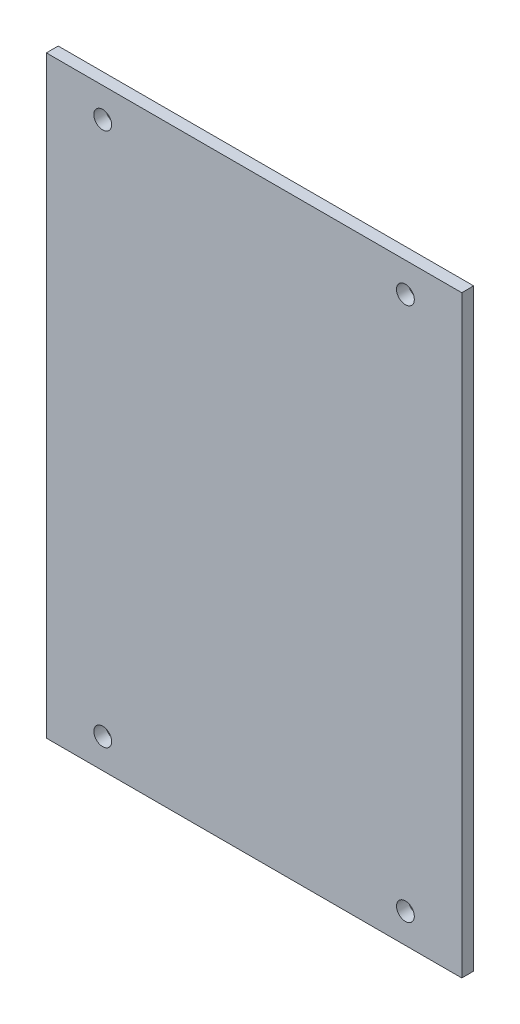
ISO-10303-21;
HEADER;
FILE_DESCRIPTION(('STEP AP214'),'2;1');
FILE_NAME('part.step','',(''),(''),'','','');
FILE_SCHEMA(('AUTOMOTIVE_DESIGN { 1 0 10303 214 1 1 1 1 }'));
ENDSEC;
DATA;
#1=APPLICATION_CONTEXT('core data for automotive mechanical design processes');
#2=APPLICATION_PROTOCOL_DEFINITION('international standard','automotive_design',2000,#1);
#3=PRODUCT_CONTEXT('',#1,'mechanical');
#4=PRODUCT('Part','Part','',(#3));
#5=PRODUCT_RELATED_PRODUCT_CATEGORY('part','',(#4));
#6=PRODUCT_DEFINITION_FORMATION('','',#4);
#7=PRODUCT_DEFINITION_CONTEXT('part definition',#1,'design');
#8=PRODUCT_DEFINITION('design','',#6,#7);
#9=PRODUCT_DEFINITION_SHAPE('','',#8);
#10=(LENGTH_UNIT() NAMED_UNIT(*) SI_UNIT(.MILLI.,.METRE.));
#11=(NAMED_UNIT(*) PLANE_ANGLE_UNIT() SI_UNIT($,.RADIAN.));
#12=(NAMED_UNIT(*) SI_UNIT($,.STERADIAN.) SOLID_ANGLE_UNIT());
#13=UNCERTAINTY_MEASURE_WITH_UNIT(LENGTH_MEASURE(1.E-05),#10,'distance_accuracy_value','');
#14=(GEOMETRIC_REPRESENTATION_CONTEXT(3) GLOBAL_UNCERTAINTY_ASSIGNED_CONTEXT((#13)) GLOBAL_UNIT_ASSIGNED_CONTEXT((#10,
#11,#12)) REPRESENTATION_CONTEXT('',''));
#15=CARTESIAN_POINT('',(0.,0.,0.));
#16=DIRECTION('',(0.,0.,1.));
#17=DIRECTION('',(1.,0.,0.));
#18=AXIS2_PLACEMENT_3D('',#15,#16,#17);
#19=CARTESIAN_POINT('',(0.,0.,0.));
#20=DIRECTION('',(0.,0.,1.));
#21=DIRECTION('',(1.,0.,0.));
#22=AXIS2_PLACEMENT_3D('',#19,#20,#21);
#23=PLANE('',#22);
#24=DIRECTION('',(-1.,0.,0.));
#25=VECTOR('',#24,1.);
#26=CARTESIAN_POINT('',(-25.5,43.,0.));
#27=LINE('',#26,#25);
#28=CARTESIAN_POINT('',(25.5,43.,0.));
#29=VERTEX_POINT('',#28);
#30=CARTESIAN_POINT('',(-25.5,43.,0.));
#31=VERTEX_POINT('',#30);
#32=EDGE_CURVE('E189',#29,#31,#27,.T.);
#33=ORIENTED_EDGE('',*,*,#32,.F.);
#34=DIRECTION('',(0.,1.,0.));
#35=VECTOR('',#34,1.);
#36=CARTESIAN_POINT('',(25.5,-13.,0.));
#37=LINE('',#36,#35);
#38=CARTESIAN_POINT('',(25.5,-13.,0.));
#39=VERTEX_POINT('',#38);
#40=EDGE_CURVE('E194',#39,#29,#37,.T.);
#41=ORIENTED_EDGE('',*,*,#40,.F.);
#42=DIRECTION('',(1.,0.,0.));
#43=VECTOR('',#42,1.);
#44=CARTESIAN_POINT('',(-25.5,-13.,0.));
#45=LINE('',#44,#43);
#46=CARTESIAN_POINT('',(-25.5,-13.,0.));
#47=VERTEX_POINT('',#46);
#48=EDGE_CURVE('E48',#47,#39,#45,.T.);
#49=ORIENTED_EDGE('',*,*,#48,.F.);
#50=DIRECTION('',(0.,-1.,0.));
#51=VECTOR('',#50,1.);
#52=CARTESIAN_POINT('',(-25.5,-13.,0.));
#53=LINE('',#52,#51);
#54=EDGE_CURVE('E56',#31,#47,#53,.T.);
#55=ORIENTED_EDGE('',*,*,#54,.F.);
#56=EDGE_LOOP('',(#33,#41,#49,#55));
#57=FACE_BOUND('',#56,.T.);
#58=CARTESIAN_POINT('',(-23.5000000033561,11.0000000033561,0.));
#59=DIRECTION('',(0.,0.,1.));
#60=DIRECTION('',(1.,0.,0.));
#61=AXIS2_PLACEMENT_3D('',#58,#59,#60);
#62=CIRCLE('',#61,1.);
#63=CARTESIAN_POINT('',(-22.5000000033561,11.0000000033561,0.));
#64=VERTEX_POINT('',#63);
#65=EDGE_CURVE('E184',#64,#64,#62,.T.);
#66=ORIENTED_EDGE('',*,*,#65,.T.);
#67=EDGE_LOOP('',(#66));
#68=FACE_BOUND('',#67,.T.);
#69=CARTESIAN_POINT('',(-23.5000000033561,-11.0000000033561,0.));
#70=DIRECTION('',(0.,0.,1.));
#71=DIRECTION('',(-1.,0.,0.));
#72=AXIS2_PLACEMENT_3D('',#69,#70,#71);
#73=CIRCLE('',#72,1.);
#74=CARTESIAN_POINT('',(-24.5000000033561,-11.0000000033561,0.));
#75=VERTEX_POINT('',#74);
#76=EDGE_CURVE('E179',#75,#75,#73,.T.);
#77=ORIENTED_EDGE('',*,*,#76,.T.);
#78=EDGE_LOOP('',(#77));
#79=FACE_BOUND('',#78,.T.);
#80=CARTESIAN_POINT('',(23.5000000033561,-11.0000000033561,0.));
#81=DIRECTION('',(0.,0.,1.));
#82=DIRECTION('',(1.,0.,0.));
#83=AXIS2_PLACEMENT_3D('',#80,#81,#82);
#84=CIRCLE('',#83,1.);
#85=CARTESIAN_POINT('',(24.5000000033561,-11.0000000033561,0.));
#86=VERTEX_POINT('',#85);
#87=EDGE_CURVE('E173',#86,#86,#84,.T.);
#88=ORIENTED_EDGE('',*,*,#87,.T.);
#89=EDGE_LOOP('',(#88));
#90=FACE_BOUND('',#89,.T.);
#91=CARTESIAN_POINT('',(23.5000000033561,11.0000000033561,0.));
#92=DIRECTION('',(0.,0.,1.));
#93=DIRECTION('',(-1.,0.,0.));
#94=AXIS2_PLACEMENT_3D('',#91,#92,#93);
#95=CIRCLE('',#94,1.);
#96=CARTESIAN_POINT('',(22.5000000033561,11.0000000033561,0.));
#97=VERTEX_POINT('',#96);
#98=EDGE_CURVE('E167',#97,#97,#95,.T.);
#99=ORIENTED_EDGE('',*,*,#98,.T.);
#100=EDGE_LOOP('',(#99));
#101=FACE_BOUND('',#100,.T.);
#102=CARTESIAN_POINT('',(23.5000000033561,18.9999999966439,0.));
#103=DIRECTION('',(0.,0.,1.));
#104=DIRECTION('',(1.,0.,0.));
#105=AXIS2_PLACEMENT_3D('',#102,#103,#104);
#106=CIRCLE('',#105,1.);
#107=CARTESIAN_POINT('',(24.5000000033561,18.9999999966439,0.));
#108=VERTEX_POINT('',#107);
#109=EDGE_CURVE('E161',#108,#108,#106,.T.);
#110=ORIENTED_EDGE('',*,*,#109,.T.);
#111=EDGE_LOOP('',(#110));
#112=FACE_BOUND('',#111,.T.);
#113=CARTESIAN_POINT('',(23.5000000033561,41.000000003356,0.));
#114=DIRECTION('',(0.,0.,1.));
#115=DIRECTION('',(-1.,0.,0.));
#116=AXIS2_PLACEMENT_3D('',#113,#114,#115);
#117=CIRCLE('',#116,1.);
#118=CARTESIAN_POINT('',(22.5000000033561,41.000000003356,0.));
#119=VERTEX_POINT('',#118);
#120=EDGE_CURVE('E155',#119,#119,#117,.T.);
#121=ORIENTED_EDGE('',*,*,#120,.T.);
#122=EDGE_LOOP('',(#121));
#123=FACE_BOUND('',#122,.T.);
#124=CARTESIAN_POINT('',(-23.5000000033561,41.000000003356,0.));
#125=DIRECTION('',(0.,0.,1.));
#126=DIRECTION('',(1.,0.,0.));
#127=AXIS2_PLACEMENT_3D('',#124,#125,#126);
#128=CIRCLE('',#127,1.);
#129=CARTESIAN_POINT('',(-22.5000000033561,41.000000003356,0.));
#130=VERTEX_POINT('',#129);
#131=EDGE_CURVE('E148',#130,#130,#128,.T.);
#132=ORIENTED_EDGE('',*,*,#131,.T.);
#133=EDGE_LOOP('',(#132));
#134=FACE_BOUND('',#133,.T.);
#135=CARTESIAN_POINT('',(-23.5000000033561,18.9999999966439,0.));
#136=DIRECTION('',(0.,0.,1.));
#137=DIRECTION('',(-1.,0.,0.));
#138=AXIS2_PLACEMENT_3D('',#135,#136,#137);
#139=CIRCLE('',#138,1.);
#140=CARTESIAN_POINT('',(-24.5000000033561,18.9999999966439,0.));
#141=VERTEX_POINT('',#140);
#142=EDGE_CURVE('E145',#141,#141,#139,.T.);
#143=ORIENTED_EDGE('',*,*,#142,.T.);
#144=EDGE_LOOP('',(#143));
#145=FACE_BOUND('',#144,.T.);
#146=ADVANCED_FACE('F33',(#57,#68,#79,#90,#101,#112,#123,#134,#145),#23,.F.);
#147=CARTESIAN_POINT('',(-25.5,43.,5.));
#148=DIRECTION('',(0.,-1.,0.));
#149=DIRECTION('',(0.,0.,-1.));
#150=AXIS2_PLACEMENT_3D('',#147,#148,#149);
#151=PLANE('',#150);
#152=ORIENTED_EDGE('',*,*,#32,.T.);
#153=DIRECTION('',(0.,0.,-1.));
#154=VECTOR('',#153,1.);
#155=CARTESIAN_POINT('',(-25.5,43.,5.));
#156=LINE('',#155,#154);
#157=CARTESIAN_POINT('',(-25.5,43.,7.));
#158=VERTEX_POINT('',#157);
#159=EDGE_CURVE('E41',#158,#31,#156,.T.);
#160=ORIENTED_EDGE('',*,*,#159,.F.);
#161=DIRECTION('',(-1.,0.,0.));
#162=VECTOR('',#161,1.);
#163=CARTESIAN_POINT('',(-25.5,43.,7.));
#164=LINE('',#163,#162);
#165=CARTESIAN_POINT('',(25.5,43.,7.));
#166=VERTEX_POINT('',#165);
#167=EDGE_CURVE('E138',#166,#158,#164,.T.);
#168=ORIENTED_EDGE('',*,*,#167,.F.);
#169=DIRECTION('',(0.,0.,-1.));
#170=VECTOR('',#169,1.);
#171=CARTESIAN_POINT('',(25.5,43.,5.));
#172=LINE('',#171,#170);
#173=EDGE_CURVE('E11',#166,#29,#172,.T.);
#174=ORIENTED_EDGE('',*,*,#173,.T.);
#175=EDGE_LOOP('',(#152,#160,#168,#174));
#176=FACE_BOUND('',#175,.T.);
#177=ADVANCED_FACE('F35',(#176),#151,.F.);
#178=CARTESIAN_POINT('',(-25.5,-13.,5.));
#179=DIRECTION('',(1.,0.,0.));
#180=DIRECTION('',(0.,0.,-1.));
#181=AXIS2_PLACEMENT_3D('',#178,#179,#180);
#182=PLANE('',#181);
#183=ORIENTED_EDGE('',*,*,#54,.T.);
#184=DIRECTION('',(0.,0.,-1.));
#185=VECTOR('',#184,1.);
#186=CARTESIAN_POINT('',(-25.5,-13.,5.));
#187=LINE('',#186,#185);
#188=CARTESIAN_POINT('',(-25.5,-13.,7.));
#189=VERTEX_POINT('',#188);
#190=EDGE_CURVE('E198',#189,#47,#187,.T.);
#191=ORIENTED_EDGE('',*,*,#190,.F.);
#192=DIRECTION('',(0.,-1.,0.));
#193=VECTOR('',#192,1.);
#194=CARTESIAN_POINT('',(-25.5,43.,7.));
#195=LINE('',#194,#193);
#196=EDGE_CURVE('E124',#158,#189,#195,.T.);
#197=ORIENTED_EDGE('',*,*,#196,.F.);
#198=ORIENTED_EDGE('',*,*,#159,.T.);
#199=EDGE_LOOP('',(#183,#191,#197,#198));
#200=FACE_BOUND('',#199,.T.);
#201=ADVANCED_FACE('F200',(#200),#182,.F.);
#202=CARTESIAN_POINT('',(-25.5,-13.,5.));
#203=DIRECTION('',(0.,1.,0.));
#204=DIRECTION('',(0.,0.,1.));
#205=AXIS2_PLACEMENT_3D('',#202,#203,#204);
#206=PLANE('',#205);
#207=ORIENTED_EDGE('',*,*,#48,.T.);
#208=DIRECTION('',(0.,0.,-1.));
#209=VECTOR('',#208,1.);
#210=CARTESIAN_POINT('',(25.5,-13.,5.));
#211=LINE('',#210,#209);
#212=CARTESIAN_POINT('',(25.5,-13.,7.));
#213=VERTEX_POINT('',#212);
#214=EDGE_CURVE('E196',#213,#39,#211,.T.);
#215=ORIENTED_EDGE('',*,*,#214,.F.);
#216=DIRECTION('',(1.,0.,0.));
#217=VECTOR('',#216,1.);
#218=CARTESIAN_POINT('',(-25.5,-13.,7.));
#219=LINE('',#218,#217);
#220=EDGE_CURVE('E127',#189,#213,#219,.T.);
#221=ORIENTED_EDGE('',*,*,#220,.F.);
#222=ORIENTED_EDGE('',*,*,#190,.T.);
#223=EDGE_LOOP('',(#207,#215,#221,#222));
#224=FACE_BOUND('',#223,.T.);
#225=ADVANCED_FACE('F276',(#224),#206,.F.);
#226=CARTESIAN_POINT('',(25.5,-13.,5.));
#227=DIRECTION('',(-1.,0.,0.));
#228=DIRECTION('',(0.,0.,1.));
#229=AXIS2_PLACEMENT_3D('',#226,#227,#228);
#230=PLANE('',#229);
#231=ORIENTED_EDGE('',*,*,#40,.T.);
#232=ORIENTED_EDGE('',*,*,#173,.F.);
#233=DIRECTION('',(0.,1.,0.));
#234=VECTOR('',#233,1.);
#235=CARTESIAN_POINT('',(25.5,43.,7.));
#236=LINE('',#235,#234);
#237=EDGE_CURVE('E135',#213,#166,#236,.T.);
#238=ORIENTED_EDGE('',*,*,#237,.F.);
#239=ORIENTED_EDGE('',*,*,#214,.T.);
#240=EDGE_LOOP('',(#231,#232,#238,#239));
#241=FACE_BOUND('',#240,.T.);
#242=ADVANCED_FACE('F210',(#241),#230,.F.);
#243=CARTESIAN_POINT('',(-23.5000000033561,11.0000000033561,5.));
#244=DIRECTION('',(0.,0.,-1.));
#245=DIRECTION('',(-1.,0.,0.));
#246=AXIS2_PLACEMENT_3D('',#243,#244,#245);
#247=CYLINDRICAL_SURFACE('',#246,1.);
#248=CARTESIAN_POINT('',(-23.5000000033561,11.0000000033561,5.));
#249=DIRECTION('',(0.,0.,1.));
#250=DIRECTION('',(1.,0.,0.));
#251=AXIS2_PLACEMENT_3D('',#248,#249,#250);
#252=CIRCLE('',#251,1.);
#253=CARTESIAN_POINT('',(-22.5000000033561,11.0000000033561,5.));
#254=VERTEX_POINT('',#253);
#255=EDGE_CURVE('E176',#254,#254,#252,.T.);
#256=ORIENTED_EDGE('',*,*,#255,.T.);
#257=EDGE_LOOP('',(#256));
#258=FACE_BOUND('',#257,.T.);
#259=ORIENTED_EDGE('',*,*,#65,.F.);
#260=EDGE_LOOP('',(#259));
#261=FACE_BOUND('',#260,.T.);
#262=ADVANCED_FACE('F269',(#258,#261),#247,.F.);
#263=CARTESIAN_POINT('',(-23.5000000033561,-11.0000000033561,5.));
#264=DIRECTION('',(0.,0.,-1.));
#265=DIRECTION('',(-1.,0.,0.));
#266=AXIS2_PLACEMENT_3D('',#263,#264,#265);
#267=CYLINDRICAL_SURFACE('',#266,1.);
#268=CARTESIAN_POINT('',(-23.5000000033561,-11.0000000033561,5.));
#269=DIRECTION('',(0.,0.,1.));
#270=DIRECTION('',(-1.,0.,0.));
#271=AXIS2_PLACEMENT_3D('',#268,#269,#270);
#272=CIRCLE('',#271,1.);
#273=CARTESIAN_POINT('',(-24.5000000033561,-11.0000000033561,5.));
#274=VERTEX_POINT('',#273);
#275=EDGE_CURVE('E170',#274,#274,#272,.T.);
#276=ORIENTED_EDGE('',*,*,#275,.T.);
#277=EDGE_LOOP('',(#276));
#278=FACE_BOUND('',#277,.T.);
#279=ORIENTED_EDGE('',*,*,#76,.F.);
#280=EDGE_LOOP('',(#279));
#281=FACE_BOUND('',#280,.T.);
#282=ADVANCED_FACE('F265',(#278,#281),#267,.F.);
#283=CARTESIAN_POINT('',(23.5000000033561,-11.0000000033561,5.));
#284=DIRECTION('',(0.,0.,-1.));
#285=DIRECTION('',(-1.,0.,0.));
#286=AXIS2_PLACEMENT_3D('',#283,#284,#285);
#287=CYLINDRICAL_SURFACE('',#286,1.);
#288=CARTESIAN_POINT('',(23.5000000033561,-11.0000000033561,5.));
#289=DIRECTION('',(0.,0.,1.));
#290=DIRECTION('',(1.,0.,0.));
#291=AXIS2_PLACEMENT_3D('',#288,#289,#290);
#292=CIRCLE('',#291,1.);
#293=CARTESIAN_POINT('',(24.5000000033561,-11.0000000033561,5.));
#294=VERTEX_POINT('',#293);
#295=EDGE_CURVE('E164',#294,#294,#292,.T.);
#296=ORIENTED_EDGE('',*,*,#295,.T.);
#297=EDGE_LOOP('',(#296));
#298=FACE_BOUND('',#297,.T.);
#299=ORIENTED_EDGE('',*,*,#87,.F.);
#300=EDGE_LOOP('',(#299));
#301=FACE_BOUND('',#300,.T.);
#302=ADVANCED_FACE('F261',(#298,#301),#287,.F.);
#303=CARTESIAN_POINT('',(23.5000000033561,11.0000000033561,5.));
#304=DIRECTION('',(0.,0.,-1.));
#305=DIRECTION('',(-1.,0.,0.));
#306=AXIS2_PLACEMENT_3D('',#303,#304,#305);
#307=CYLINDRICAL_SURFACE('',#306,1.);
#308=CARTESIAN_POINT('',(23.5000000033561,11.0000000033561,5.));
#309=DIRECTION('',(0.,0.,1.));
#310=DIRECTION('',(-1.,0.,0.));
#311=AXIS2_PLACEMENT_3D('',#308,#309,#310);
#312=CIRCLE('',#311,1.);
#313=CARTESIAN_POINT('',(22.5000000033561,11.0000000033561,5.));
#314=VERTEX_POINT('',#313);
#315=EDGE_CURVE('E158',#314,#314,#312,.T.);
#316=ORIENTED_EDGE('',*,*,#315,.T.);
#317=EDGE_LOOP('',(#316));
#318=FACE_BOUND('',#317,.T.);
#319=ORIENTED_EDGE('',*,*,#98,.F.);
#320=EDGE_LOOP('',(#319));
#321=FACE_BOUND('',#320,.T.);
#322=ADVANCED_FACE('F257',(#318,#321),#307,.F.);
#323=CARTESIAN_POINT('',(23.5000000033561,18.9999999966439,5.));
#324=DIRECTION('',(0.,0.,-1.));
#325=DIRECTION('',(-1.,0.,0.));
#326=AXIS2_PLACEMENT_3D('',#323,#324,#325);
#327=CYLINDRICAL_SURFACE('',#326,1.);
#328=CARTESIAN_POINT('',(23.5000000033561,18.9999999966439,5.));
#329=DIRECTION('',(0.,0.,1.));
#330=DIRECTION('',(1.,0.,0.));
#331=AXIS2_PLACEMENT_3D('',#328,#329,#330);
#332=CIRCLE('',#331,1.);
#333=CARTESIAN_POINT('',(24.5000000033561,18.9999999966439,5.));
#334=VERTEX_POINT('',#333);
#335=EDGE_CURVE('E152',#334,#334,#332,.T.);
#336=ORIENTED_EDGE('',*,*,#335,.T.);
#337=EDGE_LOOP('',(#336));
#338=FACE_BOUND('',#337,.T.);
#339=ORIENTED_EDGE('',*,*,#109,.F.);
#340=EDGE_LOOP('',(#339));
#341=FACE_BOUND('',#340,.T.);
#342=ADVANCED_FACE('F253',(#338,#341),#327,.F.);
#343=CARTESIAN_POINT('',(23.5000000033561,41.000000003356,5.));
#344=DIRECTION('',(0.,0.,-1.));
#345=DIRECTION('',(-1.,0.,0.));
#346=AXIS2_PLACEMENT_3D('',#343,#344,#345);
#347=CYLINDRICAL_SURFACE('',#346,1.);
#348=CARTESIAN_POINT('',(23.5000000033561,41.000000003356,5.));
#349=DIRECTION('',(0.,0.,1.));
#350=DIRECTION('',(-1.,0.,0.));
#351=AXIS2_PLACEMENT_3D('',#348,#349,#350);
#352=CIRCLE('',#351,1.);
#353=CARTESIAN_POINT('',(22.5000000033561,41.000000003356,5.));
#354=VERTEX_POINT('',#353);
#355=EDGE_CURVE('E144',#354,#354,#352,.T.);
#356=ORIENTED_EDGE('',*,*,#355,.T.);
#357=EDGE_LOOP('',(#356));
#358=FACE_BOUND('',#357,.T.);
#359=ORIENTED_EDGE('',*,*,#120,.F.);
#360=EDGE_LOOP('',(#359));
#361=FACE_BOUND('',#360,.T.);
#362=ADVANCED_FACE('F246',(#358,#361),#347,.F.);
#363=CARTESIAN_POINT('',(-23.5000000033561,41.000000003356,5.));
#364=DIRECTION('',(0.,0.,-1.));
#365=DIRECTION('',(-1.,0.,0.));
#366=AXIS2_PLACEMENT_3D('',#363,#364,#365);
#367=CYLINDRICAL_SURFACE('',#366,1.);
#368=CARTESIAN_POINT('',(-23.5000000033561,41.000000003356,5.));
#369=DIRECTION('',(0.,0.,1.));
#370=DIRECTION('',(1.,0.,0.));
#371=AXIS2_PLACEMENT_3D('',#368,#369,#370);
#372=CIRCLE('',#371,1.);
#373=CARTESIAN_POINT('',(-22.5000000033561,41.000000003356,5.));
#374=VERTEX_POINT('',#373);
#375=EDGE_CURVE('E149',#374,#374,#372,.T.);
#376=ORIENTED_EDGE('',*,*,#375,.T.);
#377=EDGE_LOOP('',(#376));
#378=FACE_BOUND('',#377,.T.);
#379=ORIENTED_EDGE('',*,*,#131,.F.);
#380=EDGE_LOOP('',(#379));
#381=FACE_BOUND('',#380,.T.);
#382=ADVANCED_FACE('F235',(#378,#381),#367,.F.);
#383=CARTESIAN_POINT('',(-23.5000000033561,18.9999999966439,5.));
#384=DIRECTION('',(0.,0.,-1.));
#385=DIRECTION('',(-1.,0.,0.));
#386=AXIS2_PLACEMENT_3D('',#383,#384,#385);
#387=CYLINDRICAL_SURFACE('',#386,1.);
#388=CARTESIAN_POINT('',(-23.5000000033561,18.9999999966439,5.));
#389=DIRECTION('',(0.,0.,1.));
#390=DIRECTION('',(-1.,0.,0.));
#391=AXIS2_PLACEMENT_3D('',#388,#389,#390);
#392=CIRCLE('',#391,1.);
#393=CARTESIAN_POINT('',(-24.5000000033561,18.9999999966439,5.));
#394=VERTEX_POINT('',#393);
#395=EDGE_CURVE('E141',#394,#394,#392,.T.);
#396=ORIENTED_EDGE('',*,*,#395,.T.);
#397=EDGE_LOOP('',(#396));
#398=FACE_BOUND('',#397,.T.);
#399=ORIENTED_EDGE('',*,*,#142,.F.);
#400=EDGE_LOOP('',(#399));
#401=FACE_BOUND('',#400,.T.);
#402=ADVANCED_FACE('F232',(#398,#401),#387,.F.);
#403=CARTESIAN_POINT('',(0.,0.,5.));
#404=DIRECTION('',(0.,0.,1.));
#405=DIRECTION('',(1.,0.,0.));
#406=AXIS2_PLACEMENT_3D('',#403,#404,#405);
#407=PLANE('',#406);
#408=ORIENTED_EDGE('',*,*,#395,.F.);
#409=EDGE_LOOP('',(#408));
#410=FACE_BOUND('',#409,.T.);
#411=ADVANCED_FACE('F234',(#410),#407,.F.);
#412=ORIENTED_EDGE('',*,*,#355,.F.);
#413=EDGE_LOOP('',(#412));
#414=FACE_BOUND('',#413,.T.);
#415=ADVANCED_FACE('F242',(#414),#407,.F.);
#416=ORIENTED_EDGE('',*,*,#315,.F.);
#417=EDGE_LOOP('',(#416));
#418=FACE_BOUND('',#417,.T.);
#419=ADVANCED_FACE('F353',(#418),#407,.F.);
#420=ORIENTED_EDGE('',*,*,#275,.F.);
#421=EDGE_LOOP('',(#420));
#422=FACE_BOUND('',#421,.T.);
#423=ADVANCED_FACE('F362',(#422),#407,.F.);
#424=ORIENTED_EDGE('',*,*,#255,.F.);
#425=EDGE_LOOP('',(#424));
#426=FACE_BOUND('',#425,.T.);
#427=ADVANCED_FACE('F371',(#426),#407,.F.);
#428=ORIENTED_EDGE('',*,*,#295,.F.);
#429=EDGE_LOOP('',(#428));
#430=FACE_BOUND('',#429,.T.);
#431=ADVANCED_FACE('F380',(#430),#407,.F.);
#432=ORIENTED_EDGE('',*,*,#335,.F.);
#433=EDGE_LOOP('',(#432));
#434=FACE_BOUND('',#433,.T.);
#435=ADVANCED_FACE('F389',(#434),#407,.F.);
#436=ORIENTED_EDGE('',*,*,#375,.F.);
#437=EDGE_LOOP('',(#436));
#438=FACE_BOUND('',#437,.T.);
#439=ADVANCED_FACE('F245',(#438),#407,.F.);
#440=CARTESIAN_POINT('',(0.,0.,9.));
#441=DIRECTION('',(0.,0.,-1.));
#442=DIRECTION('',(-1.,0.,0.));
#443=AXIS2_PLACEMENT_3D('',#440,#441,#442);
#444=PLANE('',#443);
#445=DIRECTION('',(0.,-1.,0.));
#446=VECTOR('',#445,1.);
#447=CARTESIAN_POINT('',(-35.,-35.,9.));
#448=LINE('',#447,#446);
#449=CARTESIAN_POINT('',(-35.,65.,9.));
#450=VERTEX_POINT('',#449);
#451=CARTESIAN_POINT('',(-35.,-35.,9.));
#452=VERTEX_POINT('',#451);
#453=EDGE_CURVE('E109',#450,#452,#448,.T.);
#454=ORIENTED_EDGE('',*,*,#453,.T.);
#455=DIRECTION('',(1.,0.,0.));
#456=VECTOR('',#455,1.);
#457=CARTESIAN_POINT('',(-35.,-35.,9.));
#458=LINE('',#457,#456);
#459=CARTESIAN_POINT('',(35.,-35.,9.));
#460=VERTEX_POINT('',#459);
#461=EDGE_CURVE('E98',#452,#460,#458,.T.);
#462=ORIENTED_EDGE('',*,*,#461,.T.);
#463=DIRECTION('',(0.,1.,0.));
#464=VECTOR('',#463,1.);
#465=CARTESIAN_POINT('',(35.,-35.,9.));
#466=LINE('',#465,#464);
#467=CARTESIAN_POINT('',(35.,65.,9.));
#468=VERTEX_POINT('',#467);
#469=EDGE_CURVE('E108',#460,#468,#466,.T.);
#470=ORIENTED_EDGE('',*,*,#469,.T.);
#471=DIRECTION('',(-1.,0.,0.));
#472=VECTOR('',#471,1.);
#473=CARTESIAN_POINT('',(-35.,65.,9.));
#474=LINE('',#473,#472);
#475=EDGE_CURVE('E115',#468,#450,#474,.T.);
#476=ORIENTED_EDGE('',*,*,#475,.T.);
#477=EDGE_LOOP('',(#454,#462,#470,#476));
#478=FACE_BOUND('',#477,.T.);
#479=CARTESIAN_POINT('',(-25.5,-30.,9.));
#480=DIRECTION('',(0.,0.,1.));
#481=DIRECTION('',(1.,0.,0.));
#482=AXIS2_PLACEMENT_3D('',#479,#480,#481);
#483=CIRCLE('',#482,1.5);
#484=CARTESIAN_POINT('',(-24.,-30.,9.));
#485=VERTEX_POINT('',#484);
#486=EDGE_CURVE('E524',#485,#485,#483,.T.);
#487=ORIENTED_EDGE('',*,*,#486,.F.);
#488=EDGE_LOOP('',(#487));
#489=FACE_BOUND('',#488,.T.);
#490=CARTESIAN_POINT('',(25.5,-30.,9.));
#491=DIRECTION('',(0.,0.,1.));
#492=DIRECTION('',(-1.,0.,0.));
#493=AXIS2_PLACEMENT_3D('',#490,#491,#492);
#494=CIRCLE('',#493,1.5);
#495=CARTESIAN_POINT('',(24.,-30.,9.));
#496=VERTEX_POINT('',#495);
#497=EDGE_CURVE('E518',#496,#496,#494,.T.);
#498=ORIENTED_EDGE('',*,*,#497,.F.);
#499=EDGE_LOOP('',(#498));
#500=FACE_BOUND('',#499,.T.);
#501=CARTESIAN_POINT('',(25.5,60.,9.));
#502=DIRECTION('',(0.,0.,1.));
#503=DIRECTION('',(1.,0.,0.));
#504=AXIS2_PLACEMENT_3D('',#501,#502,#503);
#505=CIRCLE('',#504,1.5);
#506=CARTESIAN_POINT('',(27.,60.,9.));
#507=VERTEX_POINT('',#506);
#508=EDGE_CURVE('E512',#507,#507,#505,.T.);
#509=ORIENTED_EDGE('',*,*,#508,.F.);
#510=EDGE_LOOP('',(#509));
#511=FACE_BOUND('',#510,.T.);
#512=CARTESIAN_POINT('',(-25.5,60.,9.));
#513=DIRECTION('',(0.,0.,1.));
#514=DIRECTION('',(-1.,0.,0.));
#515=AXIS2_PLACEMENT_3D('',#512,#513,#514);
#516=CIRCLE('',#515,1.5);
#517=CARTESIAN_POINT('',(-27.,60.,9.));
#518=VERTEX_POINT('',#517);
#519=EDGE_CURVE('E503',#518,#518,#516,.T.);
#520=ORIENTED_EDGE('',*,*,#519,.F.);
#521=EDGE_LOOP('',(#520));
#522=FACE_BOUND('',#521,.T.);
#523=ADVANCED_FACE('F112',(#478,#489,#500,#511,#522),#444,.F.);
#524=CARTESIAN_POINT('',(0.,0.,7.));
#525=DIRECTION('',(0.,0.,-1.));
#526=DIRECTION('',(-1.,0.,0.));
#527=AXIS2_PLACEMENT_3D('',#524,#525,#526);
#528=PLANE('',#527);
#529=ORIENTED_EDGE('',*,*,#167,.T.);
#530=ORIENTED_EDGE('',*,*,#196,.T.);
#531=ORIENTED_EDGE('',*,*,#220,.T.);
#532=ORIENTED_EDGE('',*,*,#237,.T.);
#533=EDGE_LOOP('',(#529,#530,#531,#532));
#534=FACE_BOUND('',#533,.T.);
#535=CARTESIAN_POINT('',(25.5,60.,7.));
#536=DIRECTION('',(0.,0.,1.));
#537=DIRECTION('',(1.,0.,0.));
#538=AXIS2_PLACEMENT_3D('',#535,#536,#537);
#539=CIRCLE('',#538,1.5);
#540=CARTESIAN_POINT('',(27.,60.,7.));
#541=VERTEX_POINT('',#540);
#542=EDGE_CURVE('E509',#541,#541,#539,.T.);
#543=ORIENTED_EDGE('',*,*,#542,.T.);
#544=EDGE_LOOP('',(#543));
#545=FACE_BOUND('',#544,.T.);
#546=CARTESIAN_POINT('',(-25.5,-30.,7.));
#547=DIRECTION('',(0.,0.,1.));
#548=DIRECTION('',(1.,0.,0.));
#549=AXIS2_PLACEMENT_3D('',#546,#547,#548);
#550=CIRCLE('',#549,1.5);
#551=CARTESIAN_POINT('',(-24.,-30.,7.));
#552=VERTEX_POINT('',#551);
#553=EDGE_CURVE('E521',#552,#552,#550,.T.);
#554=ORIENTED_EDGE('',*,*,#553,.T.);
#555=EDGE_LOOP('',(#554));
#556=FACE_BOUND('',#555,.T.);
#557=DIRECTION('',(0.,-1.,0.));
#558=VECTOR('',#557,1.);
#559=CARTESIAN_POINT('',(-35.,-35.,7.));
#560=LINE('',#559,#558);
#561=CARTESIAN_POINT('',(-35.,65.,7.));
#562=VERTEX_POINT('',#561);
#563=CARTESIAN_POINT('',(-35.,-35.,7.));
#564=VERTEX_POINT('',#563);
#565=EDGE_CURVE('E123',#562,#564,#560,.T.);
#566=ORIENTED_EDGE('',*,*,#565,.F.);
#567=DIRECTION('',(-1.,0.,0.));
#568=VECTOR('',#567,1.);
#569=CARTESIAN_POINT('',(-35.,65.,7.));
#570=LINE('',#569,#568);
#571=CARTESIAN_POINT('',(35.,65.,7.));
#572=VERTEX_POINT('',#571);
#573=EDGE_CURVE('E119',#572,#562,#570,.T.);
#574=ORIENTED_EDGE('',*,*,#573,.F.);
#575=DIRECTION('',(0.,1.,0.));
#576=VECTOR('',#575,1.);
#577=CARTESIAN_POINT('',(35.,-35.,7.));
#578=LINE('',#577,#576);
#579=CARTESIAN_POINT('',(35.,-35.,7.));
#580=VERTEX_POINT('',#579);
#581=EDGE_CURVE('E535',#580,#572,#578,.T.);
#582=ORIENTED_EDGE('',*,*,#581,.F.);
#583=DIRECTION('',(1.,0.,0.));
#584=VECTOR('',#583,1.);
#585=CARTESIAN_POINT('',(-35.,-35.,7.));
#586=LINE('',#585,#584);
#587=EDGE_CURVE('E533',#564,#580,#586,.T.);
#588=ORIENTED_EDGE('',*,*,#587,.F.);
#589=EDGE_LOOP('',(#566,#574,#582,#588));
#590=FACE_BOUND('',#589,.T.);
#591=CARTESIAN_POINT('',(25.5,-30.,7.));
#592=DIRECTION('',(0.,0.,1.));
#593=DIRECTION('',(-1.,0.,0.));
#594=AXIS2_PLACEMENT_3D('',#591,#592,#593);
#595=CIRCLE('',#594,1.5);
#596=CARTESIAN_POINT('',(24.,-30.,7.));
#597=VERTEX_POINT('',#596);
#598=EDGE_CURVE('E515',#597,#597,#595,.T.);
#599=ORIENTED_EDGE('',*,*,#598,.T.);
#600=EDGE_LOOP('',(#599));
#601=FACE_BOUND('',#600,.T.);
#602=CARTESIAN_POINT('',(-25.5,60.,7.));
#603=DIRECTION('',(0.,0.,1.));
#604=DIRECTION('',(-1.,0.,0.));
#605=AXIS2_PLACEMENT_3D('',#602,#603,#604);
#606=CIRCLE('',#605,1.5);
#607=CARTESIAN_POINT('',(-27.,60.,7.));
#608=VERTEX_POINT('',#607);
#609=EDGE_CURVE('E506',#608,#608,#606,.T.);
#610=ORIENTED_EDGE('',*,*,#609,.T.);
#611=EDGE_LOOP('',(#610));
#612=FACE_BOUND('',#611,.T.);
#613=ADVANCED_FACE('F205',(#534,#545,#556,#590,#601,#612),#528,.T.);
#614=CARTESIAN_POINT('',(-35.,-35.,9.));
#615=DIRECTION('',(1.,0.,0.));
#616=DIRECTION('',(0.,1.,0.));
#617=AXIS2_PLACEMENT_3D('',#614,#615,#616);
#618=PLANE('',#617);
#619=ORIENTED_EDGE('',*,*,#565,.T.);
#620=DIRECTION('',(0.,0.,-1.));
#621=VECTOR('',#620,1.);
#622=CARTESIAN_POINT('',(-35.,-35.,9.));
#623=LINE('',#622,#621);
#624=EDGE_CURVE('E102',#452,#564,#623,.T.);
#625=ORIENTED_EDGE('',*,*,#624,.F.);
#626=ORIENTED_EDGE('',*,*,#453,.F.);
#627=DIRECTION('',(0.,0.,-1.));
#628=VECTOR('',#627,1.);
#629=CARTESIAN_POINT('',(-35.,65.,9.));
#630=LINE('',#629,#628);
#631=EDGE_CURVE('E531',#450,#562,#630,.T.);
#632=ORIENTED_EDGE('',*,*,#631,.T.);
#633=EDGE_LOOP('',(#619,#625,#626,#632));
#634=FACE_BOUND('',#633,.T.);
#635=ADVANCED_FACE('F121',(#634),#618,.F.);
#636=CARTESIAN_POINT('',(-35.,-35.,9.));
#637=DIRECTION('',(0.,1.,0.));
#638=DIRECTION('',(0.,0.,1.));
#639=AXIS2_PLACEMENT_3D('',#636,#637,#638);
#640=PLANE('',#639);
#641=ORIENTED_EDGE('',*,*,#587,.T.);
#642=DIRECTION('',(0.,0.,-1.));
#643=VECTOR('',#642,1.);
#644=CARTESIAN_POINT('',(35.,-35.,9.));
#645=LINE('',#644,#643);
#646=EDGE_CURVE('E105',#460,#580,#645,.T.);
#647=ORIENTED_EDGE('',*,*,#646,.F.);
#648=ORIENTED_EDGE('',*,*,#461,.F.);
#649=ORIENTED_EDGE('',*,*,#624,.T.);
#650=EDGE_LOOP('',(#641,#647,#648,#649));
#651=FACE_BOUND('',#650,.T.);
#652=ADVANCED_FACE('F100',(#651),#640,.F.);
#653=CARTESIAN_POINT('',(35.,-35.,9.));
#654=DIRECTION('',(-1.,0.,0.));
#655=DIRECTION('',(0.,-1.,0.));
#656=AXIS2_PLACEMENT_3D('',#653,#654,#655);
#657=PLANE('',#656);
#658=ORIENTED_EDGE('',*,*,#581,.T.);
#659=DIRECTION('',(0.,0.,-1.));
#660=VECTOR('',#659,1.);
#661=CARTESIAN_POINT('',(35.,65.,9.));
#662=LINE('',#661,#660);
#663=EDGE_CURVE('E129',#468,#572,#662,.T.);
#664=ORIENTED_EDGE('',*,*,#663,.F.);
#665=ORIENTED_EDGE('',*,*,#469,.F.);
#666=ORIENTED_EDGE('',*,*,#646,.T.);
#667=EDGE_LOOP('',(#658,#664,#665,#666));
#668=FACE_BOUND('',#667,.T.);
#669=ADVANCED_FACE('F430',(#668),#657,.F.);
#670=CARTESIAN_POINT('',(-35.,65.,9.));
#671=DIRECTION('',(0.,-1.,0.));
#672=DIRECTION('',(0.,0.,-1.));
#673=AXIS2_PLACEMENT_3D('',#670,#671,#672);
#674=PLANE('',#673);
#675=ORIENTED_EDGE('',*,*,#573,.T.);
#676=ORIENTED_EDGE('',*,*,#631,.F.);
#677=ORIENTED_EDGE('',*,*,#475,.F.);
#678=ORIENTED_EDGE('',*,*,#663,.T.);
#679=EDGE_LOOP('',(#675,#676,#677,#678));
#680=FACE_BOUND('',#679,.T.);
#681=ADVANCED_FACE('F437',(#680),#674,.F.);
#682=CARTESIAN_POINT('',(-25.5,-30.,9.));
#683=DIRECTION('',(0.,0.,-1.));
#684=DIRECTION('',(-1.,0.,0.));
#685=AXIS2_PLACEMENT_3D('',#682,#683,#684);
#686=CYLINDRICAL_SURFACE('',#685,1.5);
#687=ORIENTED_EDGE('',*,*,#486,.T.);
#688=EDGE_LOOP('',(#687));
#689=FACE_BOUND('',#688,.T.);
#690=ORIENTED_EDGE('',*,*,#553,.F.);
#691=EDGE_LOOP('',(#690));
#692=FACE_BOUND('',#691,.T.);
#693=ADVANCED_FACE('F445',(#689,#692),#686,.F.);
#694=CARTESIAN_POINT('',(25.5,-30.,9.));
#695=DIRECTION('',(0.,0.,-1.));
#696=DIRECTION('',(-1.,0.,0.));
#697=AXIS2_PLACEMENT_3D('',#694,#695,#696);
#698=CYLINDRICAL_SURFACE('',#697,1.5);
#699=ORIENTED_EDGE('',*,*,#497,.T.);
#700=EDGE_LOOP('',(#699));
#701=FACE_BOUND('',#700,.T.);
#702=ORIENTED_EDGE('',*,*,#598,.F.);
#703=EDGE_LOOP('',(#702));
#704=FACE_BOUND('',#703,.T.);
#705=ADVANCED_FACE('F453',(#701,#704),#698,.F.);
#706=CARTESIAN_POINT('',(25.5,60.,9.));
#707=DIRECTION('',(0.,0.,-1.));
#708=DIRECTION('',(-1.,0.,0.));
#709=AXIS2_PLACEMENT_3D('',#706,#707,#708);
#710=CYLINDRICAL_SURFACE('',#709,1.5);
#711=ORIENTED_EDGE('',*,*,#508,.T.);
#712=EDGE_LOOP('',(#711));
#713=FACE_BOUND('',#712,.T.);
#714=ORIENTED_EDGE('',*,*,#542,.F.);
#715=EDGE_LOOP('',(#714));
#716=FACE_BOUND('',#715,.T.);
#717=ADVANCED_FACE('F461',(#713,#716),#710,.F.);
#718=CARTESIAN_POINT('',(-25.5,60.,9.));
#719=DIRECTION('',(0.,0.,-1.));
#720=DIRECTION('',(-1.,0.,0.));
#721=AXIS2_PLACEMENT_3D('',#718,#719,#720);
#722=CYLINDRICAL_SURFACE('',#721,1.5);
#723=ORIENTED_EDGE('',*,*,#519,.T.);
#724=EDGE_LOOP('',(#723));
#725=FACE_BOUND('',#724,.T.);
#726=ORIENTED_EDGE('',*,*,#609,.F.);
#727=EDGE_LOOP('',(#726));
#728=FACE_BOUND('',#727,.T.);
#729=ADVANCED_FACE('F469',(#725,#728),#722,.F.);
#730=CLOSED_SHELL('',(#146,#177,#201,#225,#242,#262,#282,#302,#322,#342,#362,#382,#402,#411,
#415,#419,#423,#427,#431,#435,#439,#523,#613,#635,#652,#669,#681,#693,#705,#717,#729));
#731=MANIFOLD_SOLID_BREP('B2',#730);
#732=ADVANCED_BREP_SHAPE_REPRESENTATION('',(#18,#731),#14);
#733=SHAPE_DEFINITION_REPRESENTATION(#9,#732);
ENDSEC;
END-ISO-10303-21;
